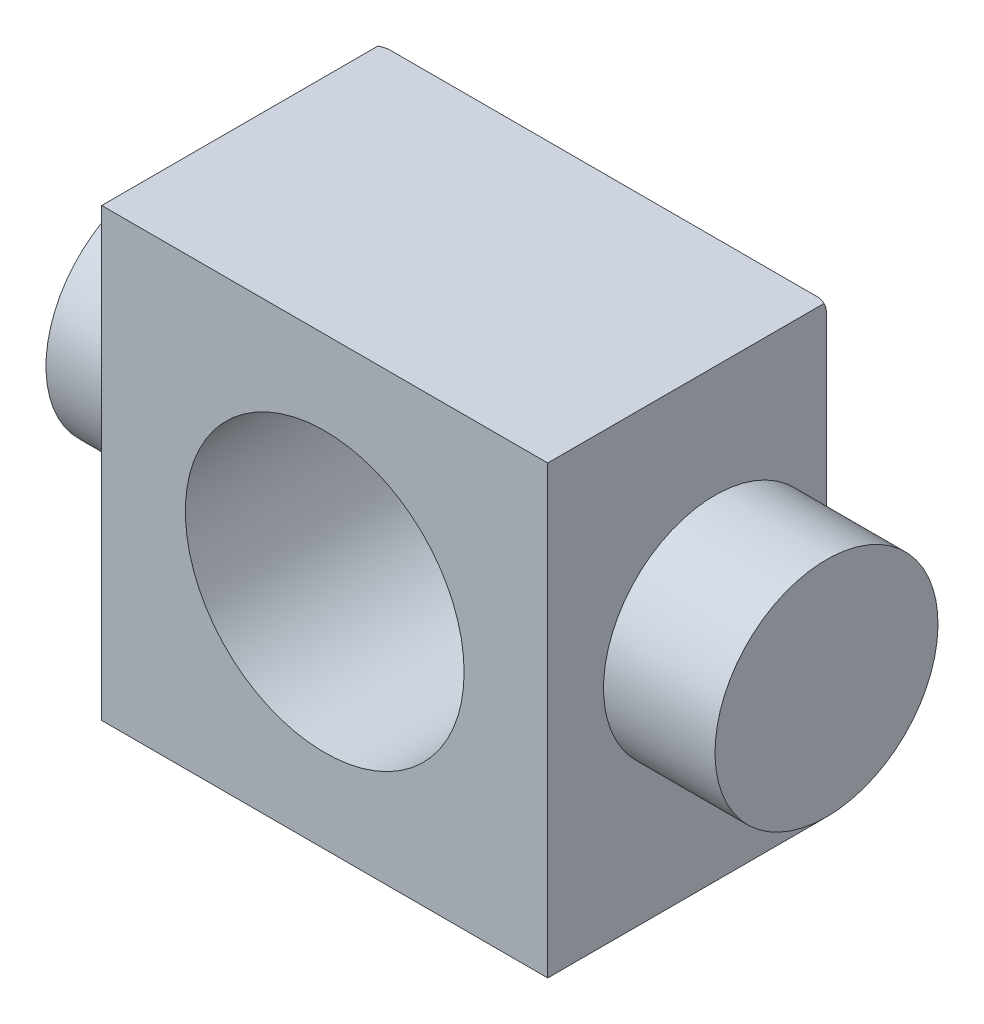
ISO-10303-21;
HEADER;
FILE_DESCRIPTION(('STEP AP214'),'2;1');
FILE_NAME('part.step','',(''),(''),'','','');
FILE_SCHEMA(('AUTOMOTIVE_DESIGN { 1 0 10303 214 1 1 1 1 }'));
ENDSEC;
DATA;
#1=APPLICATION_CONTEXT('core data for automotive mechanical design processes');
#2=APPLICATION_PROTOCOL_DEFINITION('international standard','automotive_design',2000,#1);
#3=PRODUCT_CONTEXT('',#1,'mechanical');
#4=PRODUCT('Part','Part','',(#3));
#5=PRODUCT_RELATED_PRODUCT_CATEGORY('part','',(#4));
#6=PRODUCT_DEFINITION_FORMATION('','',#4);
#7=PRODUCT_DEFINITION_CONTEXT('part definition',#1,'design');
#8=PRODUCT_DEFINITION('design','',#6,#7);
#9=PRODUCT_DEFINITION_SHAPE('','',#8);
#10=(LENGTH_UNIT() NAMED_UNIT(*) SI_UNIT(.MILLI.,.METRE.));
#11=(NAMED_UNIT(*) PLANE_ANGLE_UNIT() SI_UNIT($,.RADIAN.));
#12=(NAMED_UNIT(*) SI_UNIT($,.STERADIAN.) SOLID_ANGLE_UNIT());
#13=UNCERTAINTY_MEASURE_WITH_UNIT(LENGTH_MEASURE(1.E-05),#10,'distance_accuracy_value','');
#14=(GEOMETRIC_REPRESENTATION_CONTEXT(3) GLOBAL_UNCERTAINTY_ASSIGNED_CONTEXT((#13)) GLOBAL_UNIT_ASSIGNED_CONTEXT((#10,
#11,#12)) REPRESENTATION_CONTEXT('',''));
#15=CARTESIAN_POINT('',(0.,0.,0.));
#16=DIRECTION('',(0.,0.,1.));
#17=DIRECTION('',(1.,0.,0.));
#18=AXIS2_PLACEMENT_3D('',#15,#16,#17);
#19=CARTESIAN_POINT('',(-12.7,12.7,9.525));
#20=DIRECTION('',(1.,0.,0.));
#21=DIRECTION('',(0.,0.,-1.));
#22=AXIS2_PLACEMENT_3D('',#19,#20,#21);
#23=PLANE('',#22);
#24=DIRECTION('',(0.,0.,-1.));
#25=VECTOR('',#24,1.);
#26=CARTESIAN_POINT('',(-12.7,12.7,9.525));
#27=LINE('',#26,#25);
#28=CARTESIAN_POINT('',(-12.7,12.7,9.525));
#29=VERTEX_POINT('',#28);
#30=CARTESIAN_POINT('',(-12.7,12.7,-6.20562485747209));
#31=VERTEX_POINT('',#30);
#32=EDGE_CURVE('E262',#29,#31,#27,.T.);
#33=ORIENTED_EDGE('',*,*,#32,.T.);
#34=CARTESIAN_POINT('',(-12.7,12.7,-5.2723692654717));
#35=DIRECTION('',(1.,0.,0.));
#36=DIRECTION('',(0.,0.707106781186549,0.707106781186546));
#37=AXIS2_PLACEMENT_3D('',#34,#35,#36);
#38=ELLIPSE('',#37,1.31982271536748,0.762);
#39=CARTESIAN_POINT('',(-12.7,12.1611846327359,-6.35));
#40=VERTEX_POINT('',#39);
#41=EDGE_CURVE('E214',#31,#40,#38,.F.);
#42=ORIENTED_EDGE('',*,*,#41,.T.);
#43=DIRECTION('',(0.,-1.,0.));
#44=VECTOR('',#43,1.);
#45=CARTESIAN_POINT('',(-12.7,12.7,-6.35));
#46=LINE('',#45,#44);
#47=CARTESIAN_POINT('',(-12.7,0.,-6.35));
#48=VERTEX_POINT('',#47);
#49=EDGE_CURVE('E182',#40,#48,#46,.T.);
#50=ORIENTED_EDGE('',*,*,#49,.T.);
#51=CARTESIAN_POINT('',(-12.7,0.,0.));
#52=DIRECTION('',(1.,0.,0.));
#53=DIRECTION('',(0.,0.,-1.));
#54=AXIS2_PLACEMENT_3D('',#51,#52,#53);
#55=CIRCLE('',#54,6.35);
#56=EDGE_CURVE('E152',#48,#48,#55,.F.);
#57=ORIENTED_EDGE('',*,*,#56,.F.);
#58=DIRECTION('',(0.,-1.,0.));
#59=VECTOR('',#58,1.);
#60=CARTESIAN_POINT('',(-12.7,12.7,-6.35));
#61=LINE('',#60,#59);
#62=CARTESIAN_POINT('',(-12.7,-12.1611846327359,-6.35));
#63=VERTEX_POINT('',#62);
#64=EDGE_CURVE('E180',#48,#63,#61,.T.);
#65=ORIENTED_EDGE('',*,*,#64,.T.);
#66=CARTESIAN_POINT('',(-12.7,-12.7,-5.2723692654717));
#67=DIRECTION('',(1.,0.,0.));
#68=DIRECTION('',(0.,0.707106781186549,-0.707106781186546));
#69=AXIS2_PLACEMENT_3D('',#66,#67,#68);
#70=ELLIPSE('',#69,1.31982271536748,0.762);
#71=CARTESIAN_POINT('',(-12.7,-12.7,-6.20562485747209));
#72=VERTEX_POINT('',#71);
#73=EDGE_CURVE('E151',#63,#72,#70,.F.);
#74=ORIENTED_EDGE('',*,*,#73,.T.);
#75=DIRECTION('',(0.,0.,-1.));
#76=VECTOR('',#75,1.);
#77=CARTESIAN_POINT('',(-12.7,-12.7,9.525));
#78=LINE('',#77,#76);
#79=CARTESIAN_POINT('',(-12.7,-12.7,9.525));
#80=VERTEX_POINT('',#79);
#81=EDGE_CURVE('E132',#80,#72,#78,.T.);
#82=ORIENTED_EDGE('',*,*,#81,.F.);
#83=DIRECTION('',(0.,-1.,0.));
#84=VECTOR('',#83,1.);
#85=CARTESIAN_POINT('',(-12.7,12.7,9.525));
#86=LINE('',#85,#84);
#87=EDGE_CURVE('E138',#29,#80,#86,.T.);
#88=ORIENTED_EDGE('',*,*,#87,.F.);
#89=EDGE_LOOP('',(#33,#42,#50,#57,#65,#74,#82,#88));
#90=FACE_BOUND('',#89,.T.);
#91=ADVANCED_FACE('F35',(#90),#23,.F.);
#92=CARTESIAN_POINT('',(-12.7,-12.7,9.525));
#93=DIRECTION('',(0.,1.,0.));
#94=DIRECTION('',(0.,0.,1.));
#95=AXIS2_PLACEMENT_3D('',#92,#93,#94);
#96=PLANE('',#95);
#97=ORIENTED_EDGE('',*,*,#81,.T.);
#98=CARTESIAN_POINT('',(-12.7,-12.7,-5.2723692654717));
#99=DIRECTION('',(0.,1.,0.));
#100=DIRECTION('',(0.707106781186549,0.,-0.707106781186546));
#101=AXIS2_PLACEMENT_3D('',#98,#99,#100);
#102=ELLIPSE('',#101,1.31982271536748,0.762);
#103=CARTESIAN_POINT('',(-12.1611846327359,-12.7,-6.35));
#104=VERTEX_POINT('',#103);
#105=EDGE_CURVE('E11',#72,#104,#102,.F.);
#106=ORIENTED_EDGE('',*,*,#105,.T.);
#107=DIRECTION('',(1.,0.,0.));
#108=VECTOR('',#107,1.);
#109=CARTESIAN_POINT('',(-12.7,-12.7,-6.35));
#110=LINE('',#109,#108);
#111=CARTESIAN_POINT('',(12.1611846327359,-12.7,-6.35));
#112=VERTEX_POINT('',#111);
#113=EDGE_CURVE('E184',#104,#112,#110,.T.);
#114=ORIENTED_EDGE('',*,*,#113,.T.);
#115=CARTESIAN_POINT('',(12.7,-12.7,-5.2723692654717));
#116=DIRECTION('',(0.,1.,0.));
#117=DIRECTION('',(-0.707106781186549,0.,-0.707106781186547));
#118=AXIS2_PLACEMENT_3D('',#115,#116,#117);
#119=ELLIPSE('',#118,1.31982271536748,0.762);
#120=CARTESIAN_POINT('',(12.7,-12.7,-6.20562485747209));
#121=VERTEX_POINT('',#120);
#122=EDGE_CURVE('E43',#112,#121,#119,.F.);
#123=ORIENTED_EDGE('',*,*,#122,.T.);
#124=DIRECTION('',(0.,0.,-1.));
#125=VECTOR('',#124,1.);
#126=CARTESIAN_POINT('',(12.7,-12.7,9.525));
#127=LINE('',#126,#125);
#128=CARTESIAN_POINT('',(12.7,-12.7,9.525));
#129=VERTEX_POINT('',#128);
#130=EDGE_CURVE('E134',#129,#121,#127,.T.);
#131=ORIENTED_EDGE('',*,*,#130,.F.);
#132=DIRECTION('',(1.,0.,0.));
#133=VECTOR('',#132,1.);
#134=CARTESIAN_POINT('',(-12.7,-12.7,9.525));
#135=LINE('',#134,#133);
#136=EDGE_CURVE('E128',#80,#129,#135,.T.);
#137=ORIENTED_EDGE('',*,*,#136,.F.);
#138=EDGE_LOOP('',(#97,#106,#114,#123,#131,#137));
#139=FACE_BOUND('',#138,.T.);
#140=ADVANCED_FACE('F130',(#139),#96,.F.);
#141=CARTESIAN_POINT('',(12.7,12.7,9.525));
#142=DIRECTION('',(-1.,0.,0.));
#143=DIRECTION('',(0.,-1.,0.));
#144=AXIS2_PLACEMENT_3D('',#141,#142,#143);
#145=PLANE('',#144);
#146=DIRECTION('',(0.,1.,0.));
#147=VECTOR('',#146,1.);
#148=CARTESIAN_POINT('',(12.7,12.7,-6.35));
#149=LINE('',#148,#147);
#150=CARTESIAN_POINT('',(12.7,0.,-6.35));
#151=VERTEX_POINT('',#150);
#152=CARTESIAN_POINT('',(12.7,12.1611846327359,-6.35));
#153=VERTEX_POINT('',#152);
#154=EDGE_CURVE('E155',#151,#153,#149,.T.);
#155=ORIENTED_EDGE('',*,*,#154,.T.);
#156=CARTESIAN_POINT('',(12.7,12.7,-5.2723692654717));
#157=DIRECTION('',(-1.,0.,0.));
#158=DIRECTION('',(0.,0.707106781186549,0.707106781186546));
#159=AXIS2_PLACEMENT_3D('',#156,#157,#158);
#160=ELLIPSE('',#159,1.31982271536748,0.762);
#161=CARTESIAN_POINT('',(12.7,12.7,-6.20562485747209));
#162=VERTEX_POINT('',#161);
#163=EDGE_CURVE('E194',#153,#162,#160,.F.);
#164=ORIENTED_EDGE('',*,*,#163,.T.);
#165=DIRECTION('',(0.,0.,-1.));
#166=VECTOR('',#165,1.);
#167=CARTESIAN_POINT('',(12.7,12.7,9.525));
#168=LINE('',#167,#166);
#169=CARTESIAN_POINT('',(12.7,12.7,9.525));
#170=VERTEX_POINT('',#169);
#171=EDGE_CURVE('E157',#170,#162,#168,.T.);
#172=ORIENTED_EDGE('',*,*,#171,.F.);
#173=DIRECTION('',(0.,1.,0.));
#174=VECTOR('',#173,1.);
#175=CARTESIAN_POINT('',(12.7,12.7,9.525));
#176=LINE('',#175,#174);
#177=EDGE_CURVE('E137',#129,#170,#176,.T.);
#178=ORIENTED_EDGE('',*,*,#177,.F.);
#179=ORIENTED_EDGE('',*,*,#130,.T.);
#180=CARTESIAN_POINT('',(12.7,-12.7,-5.27236926547171));
#181=DIRECTION('',(-1.,0.,0.));
#182=DIRECTION('',(0.,0.707106781186549,-0.707106781186546));
#183=AXIS2_PLACEMENT_3D('',#180,#181,#182);
#184=ELLIPSE('',#183,1.31982271536748,0.762);
#185=CARTESIAN_POINT('',(12.7,-12.1611846327358,-6.35));
#186=VERTEX_POINT('',#185);
#187=EDGE_CURVE('E192',#121,#186,#184,.F.);
#188=ORIENTED_EDGE('',*,*,#187,.T.);
#189=DIRECTION('',(0.,1.,0.));
#190=VECTOR('',#189,1.);
#191=CARTESIAN_POINT('',(12.7,12.7,-6.35));
#192=LINE('',#191,#190);
#193=EDGE_CURVE('E163',#186,#151,#192,.T.);
#194=ORIENTED_EDGE('',*,*,#193,.T.);
#195=CARTESIAN_POINT('',(12.7,0.,0.));
#196=DIRECTION('',(-1.,0.,0.));
#197=DIRECTION('',(0.,-1.,0.));
#198=AXIS2_PLACEMENT_3D('',#195,#196,#197);
#199=CIRCLE('',#198,6.35);
#200=EDGE_CURVE('E247',#151,#151,#199,.T.);
#201=ORIENTED_EDGE('',*,*,#200,.T.);
#202=EDGE_LOOP('',(#155,#164,#172,#178,#179,#188,#194,#201));
#203=FACE_BOUND('',#202,.T.);
#204=ADVANCED_FACE('F227',(#203),#145,.F.);
#205=CARTESIAN_POINT('',(-12.7,12.7,9.525));
#206=DIRECTION('',(0.,-1.,0.));
#207=DIRECTION('',(0.,0.,-1.));
#208=AXIS2_PLACEMENT_3D('',#205,#206,#207);
#209=PLANE('',#208);
#210=ORIENTED_EDGE('',*,*,#171,.T.);
#211=CARTESIAN_POINT('',(12.7,12.7,-5.2723692654717));
#212=DIRECTION('',(0.,-1.,0.));
#213=DIRECTION('',(0.707106781186549,0.,0.707106781186547));
#214=AXIS2_PLACEMENT_3D('',#211,#212,#213);
#215=ELLIPSE('',#214,1.31982271536748,0.762);
#216=CARTESIAN_POINT('',(12.1611846327359,12.7,-6.35));
#217=VERTEX_POINT('',#216);
#218=EDGE_CURVE('E198',#162,#217,#215,.F.);
#219=ORIENTED_EDGE('',*,*,#218,.T.);
#220=DIRECTION('',(-1.,0.,0.));
#221=VECTOR('',#220,1.);
#222=CARTESIAN_POINT('',(-12.7,12.7,-6.35));
#223=LINE('',#222,#221);
#224=CARTESIAN_POINT('',(-12.1611846327359,12.7,-6.35));
#225=VERTEX_POINT('',#224);
#226=EDGE_CURVE('E177',#217,#225,#223,.T.);
#227=ORIENTED_EDGE('',*,*,#226,.T.);
#228=CARTESIAN_POINT('',(-12.7,12.7,-5.2723692654717));
#229=DIRECTION('',(0.,-1.,0.));
#230=DIRECTION('',(-0.707106781186549,0.,0.707106781186546));
#231=AXIS2_PLACEMENT_3D('',#228,#229,#230);
#232=ELLIPSE('',#231,1.31982271536748,0.762);
#233=EDGE_CURVE('E196',#225,#31,#232,.F.);
#234=ORIENTED_EDGE('',*,*,#233,.T.);
#235=ORIENTED_EDGE('',*,*,#32,.F.);
#236=DIRECTION('',(-1.,0.,0.));
#237=VECTOR('',#236,1.);
#238=CARTESIAN_POINT('',(-12.7,12.7,9.525));
#239=LINE('',#238,#237);
#240=EDGE_CURVE('E143',#170,#29,#239,.T.);
#241=ORIENTED_EDGE('',*,*,#240,.F.);
#242=EDGE_LOOP('',(#210,#219,#227,#234,#235,#241));
#243=FACE_BOUND('',#242,.T.);
#244=ADVANCED_FACE('F264',(#243),#209,.F.);
#245=CARTESIAN_POINT('',(-12.7,-12.7,9.525));
#246=DIRECTION('',(0.,0.,1.));
#247=DIRECTION('',(1.,0.,0.));
#248=AXIS2_PLACEMENT_3D('',#245,#246,#247);
#249=PLANE('',#248);
#250=CARTESIAN_POINT('',(0.,0.,9.525));
#251=DIRECTION('',(0.,0.,1.));
#252=DIRECTION('',(1.,0.,0.));
#253=AXIS2_PLACEMENT_3D('',#250,#251,#252);
#254=CIRCLE('',#253,7.93749999999999);
#255=CARTESIAN_POINT('',(7.93749999999999,0.,9.525));
#256=VERTEX_POINT('',#255);
#257=EDGE_CURVE('E255',#256,#256,#254,.T.);
#258=ORIENTED_EDGE('',*,*,#257,.F.);
#259=EDGE_LOOP('',(#258));
#260=FACE_BOUND('',#259,.T.);
#261=ORIENTED_EDGE('',*,*,#87,.T.);
#262=ORIENTED_EDGE('',*,*,#136,.T.);
#263=ORIENTED_EDGE('',*,*,#177,.T.);
#264=ORIENTED_EDGE('',*,*,#240,.T.);
#265=EDGE_LOOP('',(#261,#262,#263,#264));
#266=FACE_BOUND('',#265,.T.);
#267=ADVANCED_FACE('F141',(#260,#266),#249,.T.);
#268=CARTESIAN_POINT('',(-12.7,-12.7,-9.525));
#269=DIRECTION('',(0.,0.,1.));
#270=DIRECTION('',(1.,0.,0.));
#271=AXIS2_PLACEMENT_3D('',#268,#269,#270);
#272=PLANE('',#271);
#273=CARTESIAN_POINT('',(0.,0.,-9.525));
#274=DIRECTION('',(0.,0.,1.));
#275=DIRECTION('',(1.,0.,0.));
#276=AXIS2_PLACEMENT_3D('',#273,#274,#275);
#277=CIRCLE('',#276,7.93749999999999);
#278=CARTESIAN_POINT('',(7.93749999999999,0.,-9.525));
#279=VERTEX_POINT('',#278);
#280=EDGE_CURVE('E250',#279,#279,#277,.T.);
#281=ORIENTED_EDGE('',*,*,#280,.T.);
#282=EDGE_LOOP('',(#281));
#283=FACE_BOUND('',#282,.T.);
#284=DIRECTION('',(1.,0.,0.));
#285=VECTOR('',#284,1.);
#286=CARTESIAN_POINT('',(-12.7,9.52499999999999,-9.525));
#287=LINE('',#286,#285);
#288=CARTESIAN_POINT('',(-8.98618463273584,9.52499999999999,-9.525));
#289=VERTEX_POINT('',#288);
#290=CARTESIAN_POINT('',(8.98618463273584,9.52499999999999,-9.525));
#291=VERTEX_POINT('',#290);
#292=EDGE_CURVE('E171',#289,#291,#287,.T.);
#293=ORIENTED_EDGE('',*,*,#292,.T.);
#294=CARTESIAN_POINT('',(8.44736926547169,8.44736926547169,-9.525));
#295=DIRECTION('',(0.,0.,1.));
#296=DIRECTION('',(0.707106781186547,0.707106781186548,0.));
#297=AXIS2_PLACEMENT_3D('',#294,#295,#296);
#298=ELLIPSE('',#297,1.31982271536749,0.762);
#299=CARTESIAN_POINT('',(9.52499999999999,8.98618463273584,-9.525));
#300=VERTEX_POINT('',#299);
#301=EDGE_CURVE('E211',#291,#300,#298,.F.);
#302=ORIENTED_EDGE('',*,*,#301,.T.);
#303=DIRECTION('',(0.,-1.,0.));
#304=VECTOR('',#303,1.);
#305=CARTESIAN_POINT('',(9.52499999999999,-12.7,-9.525));
#306=LINE('',#305,#304);
#307=CARTESIAN_POINT('',(9.52499999999999,-8.98618463273583,-9.525));
#308=VERTEX_POINT('',#307);
#309=EDGE_CURVE('E174',#300,#308,#306,.T.);
#310=ORIENTED_EDGE('',*,*,#309,.T.);
#311=CARTESIAN_POINT('',(8.44736926547169,-8.44736926547168,-9.525));
#312=DIRECTION('',(0.,0.,1.));
#313=DIRECTION('',(-0.707106781186547,0.707106781186548,0.));
#314=AXIS2_PLACEMENT_3D('',#311,#312,#313);
#315=ELLIPSE('',#314,1.31982271536749,0.762);
#316=CARTESIAN_POINT('',(8.98618463273585,-9.52499999999999,-9.525));
#317=VERTEX_POINT('',#316);
#318=EDGE_CURVE('E205',#308,#317,#315,.F.);
#319=ORIENTED_EDGE('',*,*,#318,.T.);
#320=DIRECTION('',(-1.,0.,0.));
#321=VECTOR('',#320,1.);
#322=CARTESIAN_POINT('',(-12.7,-9.52499999999999,-9.525));
#323=LINE('',#322,#321);
#324=CARTESIAN_POINT('',(-8.98618463273584,-9.52499999999999,-9.525));
#325=VERTEX_POINT('',#324);
#326=EDGE_CURVE('E165',#317,#325,#323,.T.);
#327=ORIENTED_EDGE('',*,*,#326,.T.);
#328=CARTESIAN_POINT('',(-8.44736926547169,-8.44736926547169,-9.525));
#329=DIRECTION('',(0.,0.,1.));
#330=DIRECTION('',(0.707106781186548,0.707106781186548,0.));
#331=AXIS2_PLACEMENT_3D('',#328,#329,#330);
#332=ELLIPSE('',#331,1.31982271536749,0.762);
#333=CARTESIAN_POINT('',(-9.52499999999999,-8.98618463273584,-9.525));
#334=VERTEX_POINT('',#333);
#335=EDGE_CURVE('E207',#325,#334,#332,.F.);
#336=ORIENTED_EDGE('',*,*,#335,.T.);
#337=DIRECTION('',(0.,1.,0.));
#338=VECTOR('',#337,1.);
#339=CARTESIAN_POINT('',(-9.52499999999999,-12.7,-9.525));
#340=LINE('',#339,#338);
#341=CARTESIAN_POINT('',(-9.52499999999999,8.98618463273584,-9.525));
#342=VERTEX_POINT('',#341);
#343=EDGE_CURVE('E168',#334,#342,#340,.T.);
#344=ORIENTED_EDGE('',*,*,#343,.T.);
#345=CARTESIAN_POINT('',(-8.44736926547169,8.44736926547169,-9.525));
#346=DIRECTION('',(0.,0.,1.));
#347=DIRECTION('',(-0.707106781186548,0.707106781186548,0.));
#348=AXIS2_PLACEMENT_3D('',#345,#346,#347);
#349=ELLIPSE('',#348,1.31982271536749,0.762);
#350=EDGE_CURVE('E209',#342,#289,#349,.F.);
#351=ORIENTED_EDGE('',*,*,#350,.T.);
#352=EDGE_LOOP('',(#293,#302,#310,#319,#327,#336,#344,#351));
#353=FACE_BOUND('',#352,.T.);
#354=ADVANCED_FACE('F237',(#283,#353),#272,.F.);
#355=CARTESIAN_POINT('',(-19.05,0.,0.));
#356=DIRECTION('',(1.,0.,0.));
#357=DIRECTION('',(0.,1.,0.));
#358=AXIS2_PLACEMENT_3D('',#355,#356,#357);
#359=CYLINDRICAL_SURFACE('',#358,6.35);
#360=CARTESIAN_POINT('',(-19.05,0.,0.));
#361=DIRECTION('',(-1.,0.,0.));
#362=DIRECTION('',(0.,-1.,0.));
#363=AXIS2_PLACEMENT_3D('',#360,#361,#362);
#364=CIRCLE('',#363,6.35);
#365=CARTESIAN_POINT('',(-19.05,-6.35,0.));
#366=VERTEX_POINT('',#365);
#367=EDGE_CURVE('E147',#366,#366,#364,.T.);
#368=ORIENTED_EDGE('',*,*,#367,.F.);
#369=EDGE_LOOP('',(#368));
#370=FACE_BOUND('',#369,.T.);
#371=ORIENTED_EDGE('',*,*,#56,.T.);
#372=EDGE_LOOP('',(#371));
#373=FACE_BOUND('',#372,.T.);
#374=ADVANCED_FACE('F325',(#370,#373),#359,.T.);
#375=CARTESIAN_POINT('',(-19.05,0.,0.));
#376=DIRECTION('',(-1.,0.,0.));
#377=DIRECTION('',(0.,-1.,0.));
#378=AXIS2_PLACEMENT_3D('',#375,#376,#377);
#379=PLANE('',#378);
#380=ORIENTED_EDGE('',*,*,#367,.T.);
#381=EDGE_LOOP('',(#380));
#382=FACE_BOUND('',#381,.T.);
#383=ADVANCED_FACE('F321',(#382),#379,.T.);
#384=CARTESIAN_POINT('',(19.05,0.,0.));
#385=DIRECTION('',(-1.,0.,0.));
#386=DIRECTION('',(0.,-1.,0.));
#387=AXIS2_PLACEMENT_3D('',#384,#385,#386);
#388=CYLINDRICAL_SURFACE('',#387,6.35);
#389=CARTESIAN_POINT('',(19.05,0.,0.));
#390=DIRECTION('',(-1.,0.,0.));
#391=DIRECTION('',(0.,-1.,0.));
#392=AXIS2_PLACEMENT_3D('',#389,#390,#391);
#393=CIRCLE('',#392,6.35);
#394=CARTESIAN_POINT('',(19.05,-6.35,0.));
#395=VERTEX_POINT('',#394);
#396=EDGE_CURVE('E249',#395,#395,#393,.T.);
#397=ORIENTED_EDGE('',*,*,#396,.T.);
#398=EDGE_LOOP('',(#397));
#399=FACE_BOUND('',#398,.T.);
#400=ORIENTED_EDGE('',*,*,#200,.F.);
#401=EDGE_LOOP('',(#400));
#402=FACE_BOUND('',#401,.T.);
#403=ADVANCED_FACE('F317',(#399,#402),#388,.T.);
#404=CARTESIAN_POINT('',(19.05,0.,0.));
#405=DIRECTION('',(1.,0.,0.));
#406=DIRECTION('',(0.,-1.,0.));
#407=AXIS2_PLACEMENT_3D('',#404,#405,#406);
#408=PLANE('',#407);
#409=ORIENTED_EDGE('',*,*,#396,.F.);
#410=EDGE_LOOP('',(#409));
#411=FACE_BOUND('',#410,.T.);
#412=ADVANCED_FACE('F291',(#411),#408,.T.);
#413=CARTESIAN_POINT('',(-12.7,12.7,-6.35));
#414=DIRECTION('',(0.707106781186546,0.,0.707106781186549));
#415=DIRECTION('',(0.707106781186549,0.,-0.707106781186546));
#416=AXIS2_PLACEMENT_3D('',#413,#414,#415);
#417=PLANE('',#416);
#418=ORIENTED_EDGE('',*,*,#49,.F.);
#419=DIRECTION('',(0.577350269189626,-0.577350269189626,-0.577350269189625));
#420=VECTOR('',#419,1.);
#421=CARTESIAN_POINT('',(-12.8796051224214,12.3407897551572,-6.17039487757862));
#422=LINE('',#421,#420);
#423=EDGE_CURVE('E218',#40,#342,#422,.T.);
#424=ORIENTED_EDGE('',*,*,#423,.T.);
#425=ORIENTED_EDGE('',*,*,#343,.F.);
#426=DIRECTION('',(-0.577350269189626,-0.577350269189626,0.577350269189625));
#427=VECTOR('',#426,1.);
#428=CARTESIAN_POINT('',(-4.4129384557547,-3.87412308849055,-14.6370615442453));
#429=LINE('',#428,#427);
#430=EDGE_CURVE('E216',#334,#63,#429,.T.);
#431=ORIENTED_EDGE('',*,*,#430,.T.);
#432=ORIENTED_EDGE('',*,*,#64,.F.);
#433=EDGE_LOOP('',(#418,#424,#425,#431,#432));
#434=FACE_BOUND('',#433,.T.);
#435=ADVANCED_FACE('F275',(#434),#417,.F.);
#436=CARTESIAN_POINT('',(-12.7,-12.7,-6.35));
#437=DIRECTION('',(0.,0.707106781186546,0.707106781186549));
#438=DIRECTION('',(0.,-0.707106781186549,0.707106781186546));
#439=AXIS2_PLACEMENT_3D('',#436,#437,#438);
#440=PLANE('',#439);
#441=ORIENTED_EDGE('',*,*,#113,.F.);
#442=DIRECTION('',(-0.577350269189626,-0.577350269189626,0.577350269189625));
#443=VECTOR('',#442,1.);
#444=CARTESIAN_POINT('',(-12.3407897551572,-12.8796051224214,-6.17039487757862));
#445=LINE('',#444,#443);
#446=EDGE_CURVE('E221',#104,#325,#445,.F.);
#447=ORIENTED_EDGE('',*,*,#446,.T.);
#448=ORIENTED_EDGE('',*,*,#326,.F.);
#449=DIRECTION('',(0.577350269189626,-0.577350269189627,0.577350269189625));
#450=VECTOR('',#449,1.);
#451=CARTESIAN_POINT('',(3.87412308849056,-4.4129384557547,-14.6370615442453));
#452=LINE('',#451,#450);
#453=EDGE_CURVE('E50',#317,#112,#452,.T.);
#454=ORIENTED_EDGE('',*,*,#453,.T.);
#455=EDGE_LOOP('',(#441,#447,#448,#454));
#456=FACE_BOUND('',#455,.T.);
#457=ADVANCED_FACE('F281',(#456),#440,.F.);
#458=CARTESIAN_POINT('',(-12.7,12.7,-6.35));
#459=DIRECTION('',(0.,-0.707106781186546,0.707106781186549));
#460=DIRECTION('',(0.,-0.707106781186549,-0.707106781186546));
#461=AXIS2_PLACEMENT_3D('',#458,#459,#460);
#462=PLANE('',#461);
#463=ORIENTED_EDGE('',*,*,#226,.F.);
#464=DIRECTION('',(-0.577350269189626,-0.577350269189627,-0.577350269189625));
#465=VECTOR('',#464,1.);
#466=CARTESIAN_POINT('',(3.87412308849056,4.4129384557547,-14.6370615442453));
#467=LINE('',#466,#465);
#468=EDGE_CURVE('E203',#217,#291,#467,.T.);
#469=ORIENTED_EDGE('',*,*,#468,.T.);
#470=ORIENTED_EDGE('',*,*,#292,.F.);
#471=DIRECTION('',(0.577350269189626,-0.577350269189626,-0.577350269189625));
#472=VECTOR('',#471,1.);
#473=CARTESIAN_POINT('',(-12.3407897551572,12.8796051224214,-6.17039487757862));
#474=LINE('',#473,#472);
#475=EDGE_CURVE('E200',#289,#225,#474,.F.);
#476=ORIENTED_EDGE('',*,*,#475,.T.);
#477=EDGE_LOOP('',(#463,#469,#470,#476));
#478=FACE_BOUND('',#477,.T.);
#479=ADVANCED_FACE('F283',(#478),#462,.F.);
#480=CARTESIAN_POINT('',(12.7,12.7,-6.35));
#481=DIRECTION('',(-0.707106781186547,0.,0.707106781186549));
#482=DIRECTION('',(0.707106781186549,0.,0.707106781186547));
#483=AXIS2_PLACEMENT_3D('',#480,#481,#482);
#484=PLANE('',#483);
#485=ORIENTED_EDGE('',*,*,#309,.F.);
#486=DIRECTION('',(-0.577350269189626,-0.577350269189627,-0.577350269189625));
#487=VECTOR('',#486,1.);
#488=CARTESIAN_POINT('',(12.8796051224214,12.3407897551572,-6.17039487757862));
#489=LINE('',#488,#487);
#490=EDGE_CURVE('E189',#300,#153,#489,.F.);
#491=ORIENTED_EDGE('',*,*,#490,.T.);
#492=ORIENTED_EDGE('',*,*,#154,.F.);
#493=ORIENTED_EDGE('',*,*,#193,.F.);
#494=DIRECTION('',(0.577350269189626,-0.577350269189627,0.577350269189625));
#495=VECTOR('',#494,1.);
#496=CARTESIAN_POINT('',(4.4129384557547,-3.87412308849055,-14.6370615442453));
#497=LINE('',#496,#495);
#498=EDGE_CURVE('E186',#186,#308,#497,.F.);
#499=ORIENTED_EDGE('',*,*,#498,.T.);
#500=EDGE_LOOP('',(#485,#491,#492,#493,#499));
#501=FACE_BOUND('',#500,.T.);
#502=ADVANCED_FACE('F233',(#501),#484,.F.);
#503=CARTESIAN_POINT('',(0.,0.,9.525));
#504=DIRECTION('',(0.,0.,1.));
#505=DIRECTION('',(1.,0.,0.));
#506=AXIS2_PLACEMENT_3D('',#503,#504,#505);
#507=CYLINDRICAL_SURFACE('',#506,7.93749999999999);
#508=ORIENTED_EDGE('',*,*,#280,.F.);
#509=EDGE_LOOP('',(#508));
#510=FACE_BOUND('',#509,.T.);
#511=ORIENTED_EDGE('',*,*,#257,.T.);
#512=EDGE_LOOP('',(#511));
#513=FACE_BOUND('',#512,.T.);
#514=ADVANCED_FACE('F302',(#510,#513),#507,.F.);
#515=CARTESIAN_POINT('',(12.3407897551572,12.3407897551572,-5.63157951031447));
#516=DIRECTION('',(0.577350269189626,0.577350269189627,0.577350269189625));
#517=DIRECTION('',(-0.707106781186548,0.707106781186547,0.));
#518=AXIS2_PLACEMENT_3D('',#515,#516,#517);
#519=CYLINDRICAL_SURFACE('',#518,0.762);
#520=ORIENTED_EDGE('',*,*,#301,.F.);
#521=ORIENTED_EDGE('',*,*,#468,.F.);
#522=ORIENTED_EDGE('',*,*,#218,.F.);
#523=ORIENTED_EDGE('',*,*,#163,.F.);
#524=ORIENTED_EDGE('',*,*,#490,.F.);
#525=EDGE_LOOP('',(#520,#521,#522,#523,#524));
#526=FACE_BOUND('',#525,.T.);
#527=ADVANCED_FACE('F242',(#526),#519,.T.);
#528=CARTESIAN_POINT('',(-12.3407897551572,12.3407897551572,-5.63157951031447));
#529=DIRECTION('',(-0.577350269189626,0.577350269189626,0.577350269189625));
#530=DIRECTION('',(-0.707106781186547,-0.707106781186547,0.));
#531=AXIS2_PLACEMENT_3D('',#528,#529,#530);
#532=CYLINDRICAL_SURFACE('',#531,0.762);
#533=ORIENTED_EDGE('',*,*,#350,.F.);
#534=ORIENTED_EDGE('',*,*,#423,.F.);
#535=ORIENTED_EDGE('',*,*,#41,.F.);
#536=ORIENTED_EDGE('',*,*,#233,.F.);
#537=ORIENTED_EDGE('',*,*,#475,.F.);
#538=EDGE_LOOP('',(#533,#534,#535,#536,#537));
#539=FACE_BOUND('',#538,.T.);
#540=ADVANCED_FACE('F271',(#539),#532,.T.);
#541=CARTESIAN_POINT('',(-12.3407897551572,-12.3407897551572,-5.63157951031447));
#542=DIRECTION('',(0.577350269189626,0.577350269189626,-0.577350269189625));
#543=DIRECTION('',(-0.707106781186547,0.707106781186547,0.));
#544=AXIS2_PLACEMENT_3D('',#541,#542,#543);
#545=CYLINDRICAL_SURFACE('',#544,0.762);
#546=ORIENTED_EDGE('',*,*,#73,.F.);
#547=ORIENTED_EDGE('',*,*,#430,.F.);
#548=ORIENTED_EDGE('',*,*,#335,.F.);
#549=ORIENTED_EDGE('',*,*,#446,.F.);
#550=ORIENTED_EDGE('',*,*,#105,.F.);
#551=EDGE_LOOP('',(#546,#547,#548,#549,#550));
#552=FACE_BOUND('',#551,.T.);
#553=ADVANCED_FACE('F280',(#552),#545,.T.);
#554=CARTESIAN_POINT('',(3.87412308849056,-3.87412308849054,-14.0982461769811));
#555=DIRECTION('',(-0.577350269189626,0.577350269189627,-0.577350269189625));
#556=DIRECTION('',(-0.707106781186548,-0.707106781186547,0.));
#557=AXIS2_PLACEMENT_3D('',#554,#555,#556);
#558=CYLINDRICAL_SURFACE('',#557,0.762);
#559=ORIENTED_EDGE('',*,*,#122,.F.);
#560=ORIENTED_EDGE('',*,*,#453,.F.);
#561=ORIENTED_EDGE('',*,*,#318,.F.);
#562=ORIENTED_EDGE('',*,*,#498,.F.);
#563=ORIENTED_EDGE('',*,*,#187,.F.);
#564=EDGE_LOOP('',(#559,#560,#561,#562,#563));
#565=FACE_BOUND('',#564,.T.);
#566=ADVANCED_FACE('F37',(#565),#558,.T.);
#567=CLOSED_SHELL('',(#91,#140,#204,#244,#267,#354,#374,#383,#403,#412,#435,#457,#479,#502,#514,
#527,#540,#553,#566));
#568=MANIFOLD_SOLID_BREP('B2',#567);
#569=ADVANCED_BREP_SHAPE_REPRESENTATION('',(#18,#568),#14);
#570=SHAPE_DEFINITION_REPRESENTATION(#9,#569);
ENDSEC;
END-ISO-10303-21;
